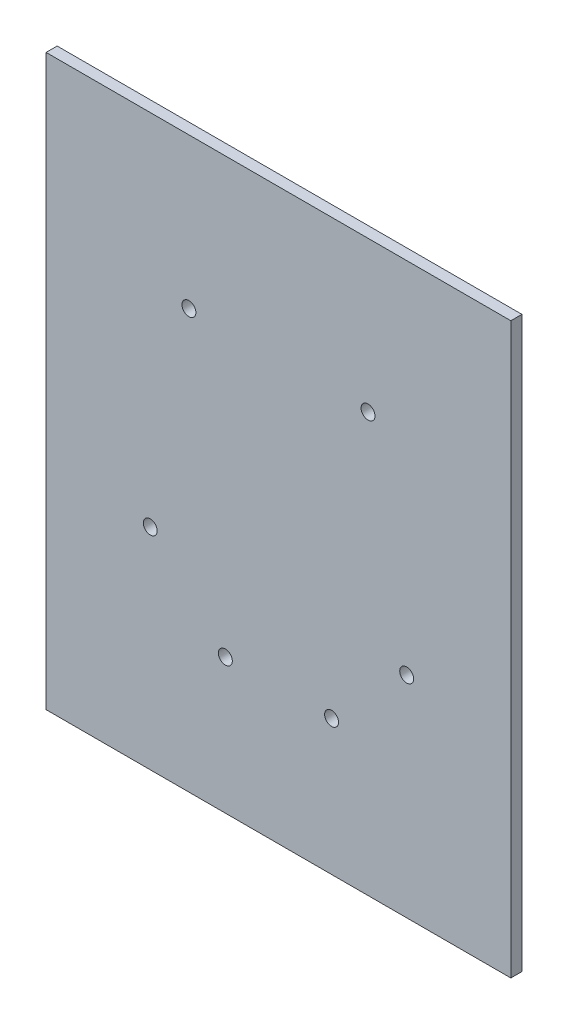
ISO-10303-21;
HEADER;
FILE_DESCRIPTION(('STEP AP214'),'2;1');
FILE_NAME('part.step','',(''),(''),'','','');
FILE_SCHEMA(('AUTOMOTIVE_DESIGN { 1 0 10303 214 1 1 1 1 }'));
ENDSEC;
DATA;
#1=APPLICATION_CONTEXT('core data for automotive mechanical design processes');
#2=APPLICATION_PROTOCOL_DEFINITION('international standard','automotive_design',2000,#1);
#3=PRODUCT_CONTEXT('',#1,'mechanical');
#4=PRODUCT('Part','Part','',(#3));
#5=PRODUCT_RELATED_PRODUCT_CATEGORY('part','',(#4));
#6=PRODUCT_DEFINITION_FORMATION('','',#4);
#7=PRODUCT_DEFINITION_CONTEXT('part definition',#1,'design');
#8=PRODUCT_DEFINITION('design','',#6,#7);
#9=PRODUCT_DEFINITION_SHAPE('','',#8);
#10=(LENGTH_UNIT() NAMED_UNIT(*) SI_UNIT(.MILLI.,.METRE.));
#11=(NAMED_UNIT(*) PLANE_ANGLE_UNIT() SI_UNIT($,.RADIAN.));
#12=(NAMED_UNIT(*) SI_UNIT($,.STERADIAN.) SOLID_ANGLE_UNIT());
#13=UNCERTAINTY_MEASURE_WITH_UNIT(LENGTH_MEASURE(1.E-05),#10,'distance_accuracy_value','');
#14=(GEOMETRIC_REPRESENTATION_CONTEXT(3) GLOBAL_UNCERTAINTY_ASSIGNED_CONTEXT((#13)) GLOBAL_UNIT_ASSIGNED_CONTEXT((#10,
#11,#12)) REPRESENTATION_CONTEXT('',''));
#15=CARTESIAN_POINT('',(0.,0.,0.));
#16=DIRECTION('',(0.,0.,1.));
#17=DIRECTION('',(1.,0.,0.));
#18=AXIS2_PLACEMENT_3D('',#15,#16,#17);
#19=CARTESIAN_POINT('',(0.,329.819,-229.489));
#20=DIRECTION('',(0.,0.,1.));
#21=DIRECTION('',(1.,0.,0.));
#22=AXIS2_PLACEMENT_3D('',#19,#20,#21);
#23=PLANE('',#22);
#24=DIRECTION('',(1.,0.,0.));
#25=VECTOR('',#24,1.);
#26=CARTESIAN_POINT('',(3.175,3.175,-229.489));
#27=LINE('',#26,#25);
#28=CARTESIAN_POINT('',(-263.525,3.17500000000004,-229.489));
#29=VERTEX_POINT('',#28);
#30=CARTESIAN_POINT('',(3.175,3.175,-229.489));
#31=VERTEX_POINT('',#30);
#32=EDGE_CURVE('E48',#29,#31,#27,.T.);
#33=ORIENTED_EDGE('',*,*,#32,.T.);
#34=DIRECTION('',(0.,1.,0.));
#35=VECTOR('',#34,1.);
#36=CARTESIAN_POINT('',(3.175,-3.175,-229.489));
#37=LINE('',#36,#35);
#38=CARTESIAN_POINT('',(3.175,329.819,-229.489));
#39=VERTEX_POINT('',#38);
#40=EDGE_CURVE('E77',#31,#39,#37,.T.);
#41=ORIENTED_EDGE('',*,*,#40,.T.);
#42=DIRECTION('',(-1.,0.,0.));
#43=VECTOR('',#42,1.);
#44=CARTESIAN_POINT('',(0.,329.819,-229.489));
#45=LINE('',#44,#43);
#46=CARTESIAN_POINT('',(-263.525,329.819,-229.489));
#47=VERTEX_POINT('',#46);
#48=EDGE_CURVE('E11',#39,#47,#45,.T.);
#49=ORIENTED_EDGE('',*,*,#48,.T.);
#50=DIRECTION('',(0.,-1.,0.));
#51=VECTOR('',#50,1.);
#52=CARTESIAN_POINT('',(-263.525,53.975,-229.489));
#53=LINE('',#52,#51);
#54=EDGE_CURVE('E85',#47,#29,#53,.T.);
#55=ORIENTED_EDGE('',*,*,#54,.T.);
#56=EDGE_LOOP('',(#33,#41,#49,#55));
#57=FACE_BOUND('',#56,.T.);
#58=CARTESIAN_POINT('',(-56.5897706188681,123.877229381132,-229.489));
#59=DIRECTION('',(0.,0.,1.));
#60=DIRECTION('',(1.,0.,0.));
#61=AXIS2_PLACEMENT_3D('',#58,#59,#60);
#62=CIRCLE('',#61,4.0005);
#63=CARTESIAN_POINT('',(-52.5892706188681,123.877229381132,-229.489));
#64=VERTEX_POINT('',#63);
#65=EDGE_CURVE('E119',#64,#64,#62,.T.);
#66=ORIENTED_EDGE('',*,*,#65,.F.);
#67=EDGE_LOOP('',(#66));
#68=FACE_BOUND('',#67,.T.);
#69=CARTESIAN_POINT('',(-203.760229381132,123.877229381132,-229.489));
#70=DIRECTION('',(0.,0.,1.));
#71=DIRECTION('',(1.,0.,0.));
#72=AXIS2_PLACEMENT_3D('',#69,#70,#71);
#73=CIRCLE('',#72,4.00049999999998);
#74=CARTESIAN_POINT('',(-199.759729381132,123.877229381132,-229.489));
#75=VERTEX_POINT('',#74);
#76=EDGE_CURVE('E124',#75,#75,#73,.T.);
#77=ORIENTED_EDGE('',*,*,#76,.F.);
#78=EDGE_LOOP('',(#77));
#79=FACE_BOUND('',#78,.T.);
#80=CARTESIAN_POINT('',(-99.695,80.772,-229.489));
#81=DIRECTION('',(0.,0.,1.));
#82=DIRECTION('',(1.,0.,0.));
#83=AXIS2_PLACEMENT_3D('',#80,#81,#82);
#84=CIRCLE('',#83,4.00050000000001);
#85=CARTESIAN_POINT('',(-95.6945,80.772,-229.489));
#86=VERTEX_POINT('',#85);
#87=EDGE_CURVE('E127',#86,#86,#84,.T.);
#88=ORIENTED_EDGE('',*,*,#87,.F.);
#89=EDGE_LOOP('',(#88));
#90=FACE_BOUND('',#89,.T.);
#91=CARTESIAN_POINT('',(-160.655,80.772,-229.489));
#92=DIRECTION('',(0.,0.,1.));
#93=DIRECTION('',(1.,0.,0.));
#94=AXIS2_PLACEMENT_3D('',#91,#92,#93);
#95=CIRCLE('',#94,4.00049999999998);
#96=CARTESIAN_POINT('',(-156.6545,80.772,-229.489));
#97=VERTEX_POINT('',#96);
#98=EDGE_CURVE('E130',#97,#97,#95,.T.);
#99=ORIENTED_EDGE('',*,*,#98,.F.);
#100=EDGE_LOOP('',(#99));
#101=FACE_BOUND('',#100,.T.);
#102=CARTESIAN_POINT('',(-78.7781,243.459,-229.489));
#103=DIRECTION('',(0.,0.,1.));
#104=DIRECTION('',(1.,0.,0.));
#105=AXIS2_PLACEMENT_3D('',#102,#103,#104);
#106=CIRCLE('',#105,4.00050000000001);
#107=CARTESIAN_POINT('',(-74.7776,243.459,-229.489));
#108=VERTEX_POINT('',#107);
#109=EDGE_CURVE('E133',#108,#108,#106,.T.);
#110=ORIENTED_EDGE('',*,*,#109,.F.);
#111=EDGE_LOOP('',(#110));
#112=FACE_BOUND('',#111,.T.);
#113=CARTESIAN_POINT('',(-181.5719,243.459,-229.489));
#114=DIRECTION('',(0.,0.,1.));
#115=DIRECTION('',(1.,0.,0.));
#116=AXIS2_PLACEMENT_3D('',#113,#114,#115);
#117=CIRCLE('',#116,4.00049999999998);
#118=CARTESIAN_POINT('',(-177.5714,243.459,-229.489));
#119=VERTEX_POINT('',#118);
#120=EDGE_CURVE('E41',#119,#119,#117,.T.);
#121=ORIENTED_EDGE('',*,*,#120,.F.);
#122=EDGE_LOOP('',(#121));
#123=FACE_BOUND('',#122,.T.);
#124=ADVANCED_FACE('F33',(#57,#68,#79,#90,#101,#112,#123),#23,.T.);
#125=CARTESIAN_POINT('',(0.,329.819,0.));
#126=DIRECTION('',(0.,1.,0.));
#127=DIRECTION('',(0.,0.,1.));
#128=AXIS2_PLACEMENT_3D('',#125,#126,#127);
#129=PLANE('',#128);
#130=ORIENTED_EDGE('',*,*,#48,.F.);
#131=DIRECTION('',(0.,0.,1.));
#132=VECTOR('',#131,1.);
#133=CARTESIAN_POINT('',(3.175,329.819,-235.839));
#134=LINE('',#133,#132);
#135=CARTESIAN_POINT('',(3.175,329.819,-235.839));
#136=VERTEX_POINT('',#135);
#137=EDGE_CURVE('E88',#136,#39,#134,.T.);
#138=ORIENTED_EDGE('',*,*,#137,.F.);
#139=DIRECTION('',(1.,0.,0.));
#140=VECTOR('',#139,1.);
#141=CARTESIAN_POINT('',(3.175,329.819,-235.839));
#142=LINE('',#141,#140);
#143=CARTESIAN_POINT('',(-263.525,329.819,-235.839));
#144=VERTEX_POINT('',#143);
#145=EDGE_CURVE('E114',#144,#136,#142,.T.);
#146=ORIENTED_EDGE('',*,*,#145,.F.);
#147=DIRECTION('',(0.,0.,-1.));
#148=VECTOR('',#147,1.);
#149=CARTESIAN_POINT('',(-263.525,329.819,-235.839));
#150=LINE('',#149,#148);
#151=EDGE_CURVE('E112',#47,#144,#150,.T.);
#152=ORIENTED_EDGE('',*,*,#151,.F.);
#153=EDGE_LOOP('',(#130,#138,#146,#152));
#154=FACE_BOUND('',#153,.T.);
#155=ADVANCED_FACE('F35',(#154),#129,.T.);
#156=CARTESIAN_POINT('',(-181.5719,243.459,-232.664));
#157=DIRECTION('',(0.,0.,1.));
#158=DIRECTION('',(1.,0.,0.));
#159=AXIS2_PLACEMENT_3D('',#156,#157,#158);
#160=CYLINDRICAL_SURFACE('',#159,4.00049999999998);
#161=CARTESIAN_POINT('',(-181.5719,243.459,-235.839));
#162=DIRECTION('',(0.,0.,-1.));
#163=DIRECTION('',(-1.,0.,0.));
#164=AXIS2_PLACEMENT_3D('',#161,#162,#163);
#165=CIRCLE('',#164,4.00050000000001);
#166=CARTESIAN_POINT('',(-177.5714,243.459,-235.839));
#167=VERTEX_POINT('',#166);
#168=EDGE_CURVE('E105',#167,#167,#165,.T.);
#169=CARTESIAN_POINT('',(-177.5714,243.459,-229.489));
#170=CARTESIAN_POINT('',(-177.5714,243.459,-229.555145833333));
#171=CARTESIAN_POINT('',(-177.5714,243.459,-229.621291666667));
#172=CARTESIAN_POINT('',(-177.5714,243.459,-229.753583333333));
#173=CARTESIAN_POINT('',(-177.5714,243.459,-229.819729166667));
#174=CARTESIAN_POINT('',(-177.5714,243.459,-229.952020833333));
#175=CARTESIAN_POINT('',(-177.5714,243.459,-230.018166666667));
#176=CARTESIAN_POINT('',(-177.5714,243.459,-230.150458333333));
#177=CARTESIAN_POINT('',(-177.5714,243.459,-230.216604166667));
#178=CARTESIAN_POINT('',(-177.5714,243.459,-230.348895833333));
#179=CARTESIAN_POINT('',(-177.5714,243.459,-230.415041666667));
#180=CARTESIAN_POINT('',(-177.5714,243.459,-230.547333333333));
#181=CARTESIAN_POINT('',(-177.5714,243.459,-230.613479166667));
#182=CARTESIAN_POINT('',(-177.5714,243.459,-230.745770833333));
#183=CARTESIAN_POINT('',(-177.5714,243.459,-230.811916666667));
#184=CARTESIAN_POINT('',(-177.5714,243.459,-230.944208333333));
#185=CARTESIAN_POINT('',(-177.5714,243.459,-231.010354166667));
#186=CARTESIAN_POINT('',(-177.5714,243.459,-231.142645833333));
#187=CARTESIAN_POINT('',(-177.5714,243.459,-231.208791666667));
#188=CARTESIAN_POINT('',(-177.5714,243.459,-231.341083333333));
#189=CARTESIAN_POINT('',(-177.5714,243.459,-231.407229166667));
#190=CARTESIAN_POINT('',(-177.5714,243.459,-231.539520833333));
#191=CARTESIAN_POINT('',(-177.5714,243.459,-231.605666666667));
#192=CARTESIAN_POINT('',(-177.5714,243.459,-231.737958333333));
#193=CARTESIAN_POINT('',(-177.5714,243.459,-231.804104166667));
#194=CARTESIAN_POINT('',(-177.5714,243.459,-231.936395833333));
#195=CARTESIAN_POINT('',(-177.5714,243.459,-232.002541666667));
#196=CARTESIAN_POINT('',(-177.5714,243.459,-232.134833333333));
#197=CARTESIAN_POINT('',(-177.5714,243.459,-232.200979166667));
#198=CARTESIAN_POINT('',(-177.5714,243.459,-232.333270833333));
#199=CARTESIAN_POINT('',(-177.5714,243.459,-232.399416666667));
#200=CARTESIAN_POINT('',(-177.5714,243.459,-232.531708333333));
#201=CARTESIAN_POINT('',(-177.5714,243.459,-232.597854166667));
#202=CARTESIAN_POINT('',(-177.5714,243.459,-232.730145833333));
#203=CARTESIAN_POINT('',(-177.5714,243.459,-232.796291666667));
#204=CARTESIAN_POINT('',(-177.5714,243.459,-232.928583333333));
#205=CARTESIAN_POINT('',(-177.5714,243.459,-232.994729166667));
#206=CARTESIAN_POINT('',(-177.5714,243.459,-233.127020833333));
#207=CARTESIAN_POINT('',(-177.5714,243.459,-233.193166666667));
#208=CARTESIAN_POINT('',(-177.5714,243.459,-233.325458333333));
#209=CARTESIAN_POINT('',(-177.5714,243.459,-233.391604166667));
#210=CARTESIAN_POINT('',(-177.5714,243.459,-233.523895833333));
#211=CARTESIAN_POINT('',(-177.5714,243.459,-233.590041666667));
#212=CARTESIAN_POINT('',(-177.5714,243.459,-233.722333333333));
#213=CARTESIAN_POINT('',(-177.5714,243.459,-233.788479166667));
#214=CARTESIAN_POINT('',(-177.5714,243.459,-233.920770833333));
#215=CARTESIAN_POINT('',(-177.5714,243.459,-233.986916666667));
#216=CARTESIAN_POINT('',(-177.5714,243.459,-234.119208333333));
#217=CARTESIAN_POINT('',(-177.5714,243.459,-234.185354166667));
#218=CARTESIAN_POINT('',(-177.5714,243.459,-234.317645833333));
#219=CARTESIAN_POINT('',(-177.5714,243.459,-234.383791666667));
#220=CARTESIAN_POINT('',(-177.5714,243.459,-234.516083333333));
#221=CARTESIAN_POINT('',(-177.5714,243.459,-234.582229166667));
#222=CARTESIAN_POINT('',(-177.5714,243.459,-234.714520833333));
#223=CARTESIAN_POINT('',(-177.5714,243.459,-234.780666666667));
#224=CARTESIAN_POINT('',(-177.5714,243.459,-234.912958333333));
#225=CARTESIAN_POINT('',(-177.5714,243.459,-234.979104166667));
#226=CARTESIAN_POINT('',(-177.5714,243.459,-235.111395833333));
#227=CARTESIAN_POINT('',(-177.5714,243.459,-235.177541666667));
#228=CARTESIAN_POINT('',(-177.5714,243.459,-235.309833333333));
#229=CARTESIAN_POINT('',(-177.5714,243.459,-235.375979166667));
#230=CARTESIAN_POINT('',(-177.5714,243.459,-235.508270833333));
#231=CARTESIAN_POINT('',(-177.5714,243.459,-235.574416666667));
#232=CARTESIAN_POINT('',(-177.5714,243.459,-235.706708333333));
#233=CARTESIAN_POINT('',(-177.5714,243.459,-235.772854166667));
#234=CARTESIAN_POINT('',(-177.5714,243.459,-235.839));
#235=B_SPLINE_CURVE_WITH_KNOTS('',3,(#169,#170,#171,#172,#173,#174,#175,#176,#177,#178,#179,
#180,#181,#182,#183,#184,#185,#186,#187,#188,#189,#190,#191,#192,#193,#194,#195,#196,#197,#198,
#199,#200,#201,#202,#203,#204,#205,#206,#207,#208,#209,#210,#211,#212,#213,#214,#215,#216,#217,
#218,#219,#220,#221,#222,#223,#224,#225,#226,#227,#228,#229,#230,#231,#232,#233,#234),
.UNSPECIFIED.,.F.,.F.,(4,2,2,2,2,2,2,2,2,2,2,2,2,2,2,2,2,2,2,2,2,2,2,2,2,2,2,2,2,2,2,2,4),(0.,
0.198437500000009,0.396875000000019,0.595312500000028,0.79375000000001,0.992187500000019,
1.19062500000003,1.38906250000001,1.58750000000002,1.78593750000003,1.98437500000001,
2.18281250000002,2.38125000000003,2.57968750000001,2.77812500000002,2.97656250000003,
3.17500000000001,3.37343750000002,3.57187500000003,3.77031250000004,3.96875000000002,
4.16718750000003,4.36562500000004,4.56406250000002,4.76250000000003,4.96093750000004,
5.15937500000002,5.35781250000003,5.55625000000004,5.75468750000002,5.95312500000003,
6.15156250000004,6.35000000000002),.UNSPECIFIED.);
#236=EDGE_CURVE('BSEAM138',#119,#167,#235,.T.);
#237=ORIENTED_EDGE('',*,*,#120,.T.);
#238=ORIENTED_EDGE('',*,*,#168,.T.);
#239=ORIENTED_EDGE('',*,*,#236,.T.);
#240=ORIENTED_EDGE('',*,*,#236,.F.);
#241=EDGE_LOOP('',(#237,#239,#238,#240));
#242=FACE_BOUND('',#241,.T.);
#243=ADVANCED_FACE('F138',(#242),#160,.F.);
#244=CARTESIAN_POINT('',(-78.7781,243.459,-232.664));
#245=DIRECTION('',(0.,0.,1.));
#246=DIRECTION('',(1.,0.,0.));
#247=AXIS2_PLACEMENT_3D('',#244,#245,#246);
#248=CYLINDRICAL_SURFACE('',#247,4.00050000000001);
#249=CARTESIAN_POINT('',(-78.7781,243.459,-235.839));
#250=DIRECTION('',(0.,0.,-1.));
#251=DIRECTION('',(-1.,0.,0.));
#252=AXIS2_PLACEMENT_3D('',#249,#250,#251);
#253=CIRCLE('',#252,4.00050000000001);
#254=CARTESIAN_POINT('',(-74.7776,243.459,-235.839));
#255=VERTEX_POINT('',#254);
#256=EDGE_CURVE('E108',#255,#255,#253,.T.);
#257=CARTESIAN_POINT('',(-74.7776,243.459,-229.489));
#258=CARTESIAN_POINT('',(-74.7776,243.459,-229.555145833333));
#259=CARTESIAN_POINT('',(-74.7776,243.459,-229.621291666667));
#260=CARTESIAN_POINT('',(-74.7776,243.459,-229.753583333333));
#261=CARTESIAN_POINT('',(-74.7776,243.459,-229.819729166667));
#262=CARTESIAN_POINT('',(-74.7776,243.459,-229.952020833333));
#263=CARTESIAN_POINT('',(-74.7776,243.459,-230.018166666667));
#264=CARTESIAN_POINT('',(-74.7776,243.459,-230.150458333333));
#265=CARTESIAN_POINT('',(-74.7776,243.459,-230.216604166667));
#266=CARTESIAN_POINT('',(-74.7776,243.459,-230.348895833333));
#267=CARTESIAN_POINT('',(-74.7776,243.459,-230.415041666667));
#268=CARTESIAN_POINT('',(-74.7776,243.459,-230.547333333333));
#269=CARTESIAN_POINT('',(-74.7776,243.459,-230.613479166667));
#270=CARTESIAN_POINT('',(-74.7776,243.459,-230.745770833333));
#271=CARTESIAN_POINT('',(-74.7776,243.459,-230.811916666667));
#272=CARTESIAN_POINT('',(-74.7776,243.459,-230.944208333333));
#273=CARTESIAN_POINT('',(-74.7776,243.459,-231.010354166667));
#274=CARTESIAN_POINT('',(-74.7776,243.459,-231.142645833333));
#275=CARTESIAN_POINT('',(-74.7776,243.459,-231.208791666667));
#276=CARTESIAN_POINT('',(-74.7776,243.459,-231.341083333333));
#277=CARTESIAN_POINT('',(-74.7776,243.459,-231.407229166667));
#278=CARTESIAN_POINT('',(-74.7776,243.459,-231.539520833333));
#279=CARTESIAN_POINT('',(-74.7776,243.459,-231.605666666667));
#280=CARTESIAN_POINT('',(-74.7776,243.459,-231.737958333333));
#281=CARTESIAN_POINT('',(-74.7776,243.459,-231.804104166667));
#282=CARTESIAN_POINT('',(-74.7776,243.459,-231.936395833333));
#283=CARTESIAN_POINT('',(-74.7776,243.459,-232.002541666667));
#284=CARTESIAN_POINT('',(-74.7776,243.459,-232.134833333333));
#285=CARTESIAN_POINT('',(-74.7776,243.459,-232.200979166667));
#286=CARTESIAN_POINT('',(-74.7776,243.459,-232.333270833333));
#287=CARTESIAN_POINT('',(-74.7776,243.459,-232.399416666667));
#288=CARTESIAN_POINT('',(-74.7776,243.459,-232.531708333333));
#289=CARTESIAN_POINT('',(-74.7776,243.459,-232.597854166667));
#290=CARTESIAN_POINT('',(-74.7776,243.459,-232.730145833333));
#291=CARTESIAN_POINT('',(-74.7776,243.459,-232.796291666667));
#292=CARTESIAN_POINT('',(-74.7776,243.459,-232.928583333333));
#293=CARTESIAN_POINT('',(-74.7776,243.459,-232.994729166667));
#294=CARTESIAN_POINT('',(-74.7776,243.459,-233.127020833333));
#295=CARTESIAN_POINT('',(-74.7776,243.459,-233.193166666667));
#296=CARTESIAN_POINT('',(-74.7776,243.459,-233.325458333333));
#297=CARTESIAN_POINT('',(-74.7776,243.459,-233.391604166667));
#298=CARTESIAN_POINT('',(-74.7776,243.459,-233.523895833333));
#299=CARTESIAN_POINT('',(-74.7776,243.459,-233.590041666667));
#300=CARTESIAN_POINT('',(-74.7776,243.459,-233.722333333333));
#301=CARTESIAN_POINT('',(-74.7776,243.459,-233.788479166667));
#302=CARTESIAN_POINT('',(-74.7776,243.459,-233.920770833333));
#303=CARTESIAN_POINT('',(-74.7776,243.459,-233.986916666667));
#304=CARTESIAN_POINT('',(-74.7776,243.459,-234.119208333333));
#305=CARTESIAN_POINT('',(-74.7776,243.459,-234.185354166667));
#306=CARTESIAN_POINT('',(-74.7776,243.459,-234.317645833333));
#307=CARTESIAN_POINT('',(-74.7776,243.459,-234.383791666667));
#308=CARTESIAN_POINT('',(-74.7776,243.459,-234.516083333333));
#309=CARTESIAN_POINT('',(-74.7776,243.459,-234.582229166667));
#310=CARTESIAN_POINT('',(-74.7776,243.459,-234.714520833333));
#311=CARTESIAN_POINT('',(-74.7776,243.459,-234.780666666667));
#312=CARTESIAN_POINT('',(-74.7776,243.459,-234.912958333333));
#313=CARTESIAN_POINT('',(-74.7776,243.459,-234.979104166667));
#314=CARTESIAN_POINT('',(-74.7776,243.459,-235.111395833333));
#315=CARTESIAN_POINT('',(-74.7776,243.459,-235.177541666667));
#316=CARTESIAN_POINT('',(-74.7776,243.459,-235.309833333333));
#317=CARTESIAN_POINT('',(-74.7776,243.459,-235.375979166667));
#318=CARTESIAN_POINT('',(-74.7776,243.459,-235.508270833333));
#319=CARTESIAN_POINT('',(-74.7776,243.459,-235.574416666667));
#320=CARTESIAN_POINT('',(-74.7776,243.459,-235.706708333333));
#321=CARTESIAN_POINT('',(-74.7776,243.459,-235.772854166667));
#322=CARTESIAN_POINT('',(-74.7776,243.459,-235.839));
#323=B_SPLINE_CURVE_WITH_KNOTS('',3,(#257,#258,#259,#260,#261,#262,#263,#264,#265,#266,#267,
#268,#269,#270,#271,#272,#273,#274,#275,#276,#277,#278,#279,#280,#281,#282,#283,#284,#285,#286,
#287,#288,#289,#290,#291,#292,#293,#294,#295,#296,#297,#298,#299,#300,#301,#302,#303,#304,#305,
#306,#307,#308,#309,#310,#311,#312,#313,#314,#315,#316,#317,#318,#319,#320,#321,#322),
.UNSPECIFIED.,.F.,.F.,(4,2,2,2,2,2,2,2,2,2,2,2,2,2,2,2,2,2,2,2,2,2,2,2,2,2,2,2,2,2,2,2,4),(0.,
0.198437499999982,0.396874999999991,0.595312499999973,0.793749999999982,0.992187499999991,
1.19062499999997,1.38906249999998,1.58749999999999,1.78593749999997,1.98437499999998,
2.18281249999999,2.38124999999997,2.57968749999998,2.77812499999999,2.97656249999997,
3.17499999999998,3.37343749999999,3.57187499999997,3.77031249999998,3.96874999999999,
4.16718749999997,4.36562499999998,4.56406249999999,4.76249999999998,4.96093749999998,
5.15937499999999,5.35781249999998,5.55624999999998,5.75468749999999,5.95312499999998,
6.15156249999998,6.34999999999997),.UNSPECIFIED.);
#324=EDGE_CURVE('BSEAM149',#108,#255,#323,.T.);
#325=ORIENTED_EDGE('',*,*,#109,.T.);
#326=ORIENTED_EDGE('',*,*,#256,.T.);
#327=ORIENTED_EDGE('',*,*,#324,.T.);
#328=ORIENTED_EDGE('',*,*,#324,.F.);
#329=EDGE_LOOP('',(#325,#327,#326,#328));
#330=FACE_BOUND('',#329,.T.);
#331=ADVANCED_FACE('F149',(#330),#248,.F.);
#332=CARTESIAN_POINT('',(-160.655,80.772,-232.664));
#333=DIRECTION('',(0.,0.,1.));
#334=DIRECTION('',(1.,0.,0.));
#335=AXIS2_PLACEMENT_3D('',#332,#333,#334);
#336=CYLINDRICAL_SURFACE('',#335,4.00049999999998);
#337=CARTESIAN_POINT('',(-160.655,80.772,-235.839));
#338=DIRECTION('',(0.,0.,-1.));
#339=DIRECTION('',(-1.,0.,0.));
#340=AXIS2_PLACEMENT_3D('',#337,#338,#339);
#341=CIRCLE('',#340,4.00049999999998);
#342=CARTESIAN_POINT('',(-156.6545,80.772,-235.839));
#343=VERTEX_POINT('',#342);
#344=EDGE_CURVE('E96',#343,#343,#341,.T.);
#345=CARTESIAN_POINT('',(-156.6545,80.772,-229.489));
#346=CARTESIAN_POINT('',(-156.6545,80.772,-229.555145833333));
#347=CARTESIAN_POINT('',(-156.6545,80.772,-229.621291666667));
#348=CARTESIAN_POINT('',(-156.6545,80.772,-229.753583333333));
#349=CARTESIAN_POINT('',(-156.6545,80.772,-229.819729166667));
#350=CARTESIAN_POINT('',(-156.6545,80.772,-229.952020833333));
#351=CARTESIAN_POINT('',(-156.6545,80.772,-230.018166666667));
#352=CARTESIAN_POINT('',(-156.6545,80.772,-230.150458333333));
#353=CARTESIAN_POINT('',(-156.6545,80.772,-230.216604166667));
#354=CARTESIAN_POINT('',(-156.6545,80.772,-230.348895833333));
#355=CARTESIAN_POINT('',(-156.6545,80.772,-230.415041666667));
#356=CARTESIAN_POINT('',(-156.6545,80.772,-230.547333333333));
#357=CARTESIAN_POINT('',(-156.6545,80.772,-230.613479166667));
#358=CARTESIAN_POINT('',(-156.6545,80.772,-230.745770833333));
#359=CARTESIAN_POINT('',(-156.6545,80.772,-230.811916666667));
#360=CARTESIAN_POINT('',(-156.6545,80.772,-230.944208333333));
#361=CARTESIAN_POINT('',(-156.6545,80.772,-231.010354166667));
#362=CARTESIAN_POINT('',(-156.6545,80.772,-231.142645833333));
#363=CARTESIAN_POINT('',(-156.6545,80.772,-231.208791666667));
#364=CARTESIAN_POINT('',(-156.6545,80.772,-231.341083333333));
#365=CARTESIAN_POINT('',(-156.6545,80.772,-231.407229166667));
#366=CARTESIAN_POINT('',(-156.6545,80.772,-231.539520833333));
#367=CARTESIAN_POINT('',(-156.6545,80.772,-231.605666666667));
#368=CARTESIAN_POINT('',(-156.6545,80.772,-231.737958333333));
#369=CARTESIAN_POINT('',(-156.6545,80.772,-231.804104166667));
#370=CARTESIAN_POINT('',(-156.6545,80.772,-231.936395833333));
#371=CARTESIAN_POINT('',(-156.6545,80.772,-232.002541666667));
#372=CARTESIAN_POINT('',(-156.6545,80.772,-232.134833333333));
#373=CARTESIAN_POINT('',(-156.6545,80.772,-232.200979166667));
#374=CARTESIAN_POINT('',(-156.6545,80.772,-232.333270833333));
#375=CARTESIAN_POINT('',(-156.6545,80.772,-232.399416666667));
#376=CARTESIAN_POINT('',(-156.6545,80.772,-232.531708333333));
#377=CARTESIAN_POINT('',(-156.6545,80.772,-232.597854166667));
#378=CARTESIAN_POINT('',(-156.6545,80.772,-232.730145833333));
#379=CARTESIAN_POINT('',(-156.6545,80.772,-232.796291666667));
#380=CARTESIAN_POINT('',(-156.6545,80.772,-232.928583333333));
#381=CARTESIAN_POINT('',(-156.6545,80.772,-232.994729166667));
#382=CARTESIAN_POINT('',(-156.6545,80.772,-233.127020833333));
#383=CARTESIAN_POINT('',(-156.6545,80.772,-233.193166666667));
#384=CARTESIAN_POINT('',(-156.6545,80.772,-233.325458333333));
#385=CARTESIAN_POINT('',(-156.6545,80.772,-233.391604166667));
#386=CARTESIAN_POINT('',(-156.6545,80.772,-233.523895833333));
#387=CARTESIAN_POINT('',(-156.6545,80.772,-233.590041666667));
#388=CARTESIAN_POINT('',(-156.6545,80.772,-233.722333333333));
#389=CARTESIAN_POINT('',(-156.6545,80.772,-233.788479166667));
#390=CARTESIAN_POINT('',(-156.6545,80.772,-233.920770833333));
#391=CARTESIAN_POINT('',(-156.6545,80.772,-233.986916666667));
#392=CARTESIAN_POINT('',(-156.6545,80.772,-234.119208333333));
#393=CARTESIAN_POINT('',(-156.6545,80.772,-234.185354166667));
#394=CARTESIAN_POINT('',(-156.6545,80.772,-234.317645833333));
#395=CARTESIAN_POINT('',(-156.6545,80.772,-234.383791666667));
#396=CARTESIAN_POINT('',(-156.6545,80.772,-234.516083333333));
#397=CARTESIAN_POINT('',(-156.6545,80.772,-234.582229166667));
#398=CARTESIAN_POINT('',(-156.6545,80.772,-234.714520833333));
#399=CARTESIAN_POINT('',(-156.6545,80.772,-234.780666666667));
#400=CARTESIAN_POINT('',(-156.6545,80.772,-234.912958333333));
#401=CARTESIAN_POINT('',(-156.6545,80.772,-234.979104166667));
#402=CARTESIAN_POINT('',(-156.6545,80.772,-235.111395833333));
#403=CARTESIAN_POINT('',(-156.6545,80.772,-235.177541666667));
#404=CARTESIAN_POINT('',(-156.6545,80.772,-235.309833333333));
#405=CARTESIAN_POINT('',(-156.6545,80.772,-235.375979166667));
#406=CARTESIAN_POINT('',(-156.6545,80.772,-235.508270833333));
#407=CARTESIAN_POINT('',(-156.6545,80.772,-235.574416666667));
#408=CARTESIAN_POINT('',(-156.6545,80.772,-235.706708333333));
#409=CARTESIAN_POINT('',(-156.6545,80.772,-235.772854166667));
#410=CARTESIAN_POINT('',(-156.6545,80.772,-235.839));
#411=B_SPLINE_CURVE_WITH_KNOTS('',3,(#345,#346,#347,#348,#349,#350,#351,#352,#353,#354,#355,
#356,#357,#358,#359,#360,#361,#362,#363,#364,#365,#366,#367,#368,#369,#370,#371,#372,#373,#374,
#375,#376,#377,#378,#379,#380,#381,#382,#383,#384,#385,#386,#387,#388,#389,#390,#391,#392,#393,
#394,#395,#396,#397,#398,#399,#400,#401,#402,#403,#404,#405,#406,#407,#408,#409,#410),
.UNSPECIFIED.,.F.,.F.,(4,2,2,2,2,2,2,2,2,2,2,2,2,2,2,2,2,2,2,2,2,2,2,2,2,2,2,2,2,2,2,2,4),(0.,
0.198437500000009,0.396875000000019,0.595312500000028,0.79375000000001,0.992187500000019,
1.19062500000003,1.38906250000001,1.58750000000002,1.78593750000003,1.98437500000001,
2.18281250000002,2.38125000000003,2.57968750000001,2.77812500000002,2.97656250000003,
3.17500000000001,3.37343750000002,3.57187500000003,3.77031250000004,3.96875000000002,
4.16718750000003,4.36562500000004,4.56406250000002,4.76250000000003,4.96093750000004,
5.15937500000002,5.35781250000003,5.55625000000004,5.75468750000002,5.95312500000003,
6.15156250000004,6.35000000000002),.UNSPECIFIED.);
#412=EDGE_CURVE('BSEAM152',#97,#343,#411,.T.);
#413=ORIENTED_EDGE('',*,*,#98,.T.);
#414=ORIENTED_EDGE('',*,*,#344,.T.);
#415=ORIENTED_EDGE('',*,*,#412,.T.);
#416=ORIENTED_EDGE('',*,*,#412,.F.);
#417=EDGE_LOOP('',(#413,#415,#414,#416));
#418=FACE_BOUND('',#417,.T.);
#419=ADVANCED_FACE('F152',(#418),#336,.F.);
#420=CARTESIAN_POINT('',(-99.695,80.772,-232.664));
#421=DIRECTION('',(0.,0.,1.));
#422=DIRECTION('',(1.,0.,0.));
#423=AXIS2_PLACEMENT_3D('',#420,#421,#422);
#424=CYLINDRICAL_SURFACE('',#423,4.00050000000001);
#425=CARTESIAN_POINT('',(-99.695,80.772,-235.839));
#426=DIRECTION('',(0.,0.,-1.));
#427=DIRECTION('',(-1.,0.,0.));
#428=AXIS2_PLACEMENT_3D('',#425,#426,#427);
#429=CIRCLE('',#428,4.00050000000001);
#430=CARTESIAN_POINT('',(-95.6945,80.772,-235.839));
#431=VERTEX_POINT('',#430);
#432=EDGE_CURVE('E99',#431,#431,#429,.T.);
#433=CARTESIAN_POINT('',(-95.6945,80.772,-229.489));
#434=CARTESIAN_POINT('',(-95.6945,80.772,-229.555145833333));
#435=CARTESIAN_POINT('',(-95.6945,80.772,-229.621291666667));
#436=CARTESIAN_POINT('',(-95.6945,80.772,-229.753583333333));
#437=CARTESIAN_POINT('',(-95.6945,80.772,-229.819729166667));
#438=CARTESIAN_POINT('',(-95.6945,80.772,-229.952020833333));
#439=CARTESIAN_POINT('',(-95.6945,80.772,-230.018166666667));
#440=CARTESIAN_POINT('',(-95.6945,80.772,-230.150458333333));
#441=CARTESIAN_POINT('',(-95.6945,80.772,-230.216604166667));
#442=CARTESIAN_POINT('',(-95.6945,80.772,-230.348895833333));
#443=CARTESIAN_POINT('',(-95.6945,80.772,-230.415041666667));
#444=CARTESIAN_POINT('',(-95.6945,80.772,-230.547333333333));
#445=CARTESIAN_POINT('',(-95.6945,80.772,-230.613479166667));
#446=CARTESIAN_POINT('',(-95.6945,80.772,-230.745770833333));
#447=CARTESIAN_POINT('',(-95.6945,80.772,-230.811916666667));
#448=CARTESIAN_POINT('',(-95.6945,80.772,-230.944208333333));
#449=CARTESIAN_POINT('',(-95.6945,80.772,-231.010354166667));
#450=CARTESIAN_POINT('',(-95.6945,80.772,-231.142645833333));
#451=CARTESIAN_POINT('',(-95.6945,80.772,-231.208791666667));
#452=CARTESIAN_POINT('',(-95.6945,80.772,-231.341083333333));
#453=CARTESIAN_POINT('',(-95.6945,80.772,-231.407229166667));
#454=CARTESIAN_POINT('',(-95.6945,80.772,-231.539520833333));
#455=CARTESIAN_POINT('',(-95.6945,80.772,-231.605666666667));
#456=CARTESIAN_POINT('',(-95.6945,80.772,-231.737958333333));
#457=CARTESIAN_POINT('',(-95.6945,80.772,-231.804104166667));
#458=CARTESIAN_POINT('',(-95.6945,80.772,-231.936395833333));
#459=CARTESIAN_POINT('',(-95.6945,80.772,-232.002541666667));
#460=CARTESIAN_POINT('',(-95.6945,80.772,-232.134833333333));
#461=CARTESIAN_POINT('',(-95.6945,80.772,-232.200979166667));
#462=CARTESIAN_POINT('',(-95.6945,80.772,-232.333270833333));
#463=CARTESIAN_POINT('',(-95.6945,80.772,-232.399416666667));
#464=CARTESIAN_POINT('',(-95.6945,80.772,-232.531708333333));
#465=CARTESIAN_POINT('',(-95.6945,80.772,-232.597854166667));
#466=CARTESIAN_POINT('',(-95.6945,80.772,-232.730145833333));
#467=CARTESIAN_POINT('',(-95.6945,80.772,-232.796291666667));
#468=CARTESIAN_POINT('',(-95.6945,80.772,-232.928583333333));
#469=CARTESIAN_POINT('',(-95.6945,80.772,-232.994729166667));
#470=CARTESIAN_POINT('',(-95.6945,80.772,-233.127020833333));
#471=CARTESIAN_POINT('',(-95.6945,80.772,-233.193166666667));
#472=CARTESIAN_POINT('',(-95.6945,80.772,-233.325458333333));
#473=CARTESIAN_POINT('',(-95.6945,80.772,-233.391604166667));
#474=CARTESIAN_POINT('',(-95.6945,80.772,-233.523895833333));
#475=CARTESIAN_POINT('',(-95.6945,80.772,-233.590041666667));
#476=CARTESIAN_POINT('',(-95.6945,80.772,-233.722333333333));
#477=CARTESIAN_POINT('',(-95.6945,80.772,-233.788479166667));
#478=CARTESIAN_POINT('',(-95.6945,80.772,-233.920770833333));
#479=CARTESIAN_POINT('',(-95.6945,80.772,-233.986916666667));
#480=CARTESIAN_POINT('',(-95.6945,80.772,-234.119208333333));
#481=CARTESIAN_POINT('',(-95.6945,80.772,-234.185354166667));
#482=CARTESIAN_POINT('',(-95.6945,80.772,-234.317645833333));
#483=CARTESIAN_POINT('',(-95.6945,80.772,-234.383791666667));
#484=CARTESIAN_POINT('',(-95.6945,80.772,-234.516083333333));
#485=CARTESIAN_POINT('',(-95.6945,80.772,-234.582229166667));
#486=CARTESIAN_POINT('',(-95.6945,80.772,-234.714520833333));
#487=CARTESIAN_POINT('',(-95.6945,80.772,-234.780666666667));
#488=CARTESIAN_POINT('',(-95.6945,80.772,-234.912958333333));
#489=CARTESIAN_POINT('',(-95.6945,80.772,-234.979104166667));
#490=CARTESIAN_POINT('',(-95.6945,80.772,-235.111395833333));
#491=CARTESIAN_POINT('',(-95.6945,80.772,-235.177541666667));
#492=CARTESIAN_POINT('',(-95.6945,80.772,-235.309833333333));
#493=CARTESIAN_POINT('',(-95.6945,80.772,-235.375979166667));
#494=CARTESIAN_POINT('',(-95.6945,80.772,-235.508270833333));
#495=CARTESIAN_POINT('',(-95.6945,80.772,-235.574416666667));
#496=CARTESIAN_POINT('',(-95.6945,80.772,-235.706708333333));
#497=CARTESIAN_POINT('',(-95.6945,80.772,-235.772854166667));
#498=CARTESIAN_POINT('',(-95.6945,80.772,-235.839));
#499=B_SPLINE_CURVE_WITH_KNOTS('',3,(#433,#434,#435,#436,#437,#438,#439,#440,#441,#442,#443,
#444,#445,#446,#447,#448,#449,#450,#451,#452,#453,#454,#455,#456,#457,#458,#459,#460,#461,#462,
#463,#464,#465,#466,#467,#468,#469,#470,#471,#472,#473,#474,#475,#476,#477,#478,#479,#480,#481,
#482,#483,#484,#485,#486,#487,#488,#489,#490,#491,#492,#493,#494,#495,#496,#497,#498),
.UNSPECIFIED.,.F.,.F.,(4,2,2,2,2,2,2,2,2,2,2,2,2,2,2,2,2,2,2,2,2,2,2,2,2,2,2,2,2,2,2,2,4),(0.,
0.198437499999982,0.396874999999991,0.595312499999973,0.793749999999982,0.992187499999991,
1.19062499999997,1.38906249999998,1.58749999999999,1.78593749999997,1.98437499999998,
2.18281249999999,2.38124999999997,2.57968749999998,2.77812499999999,2.97656249999997,
3.17499999999998,3.37343749999999,3.57187499999997,3.77031249999998,3.96874999999999,
4.16718749999997,4.36562499999998,4.56406249999999,4.76249999999998,4.96093749999998,
5.15937499999999,5.35781249999998,5.55624999999998,5.75468749999999,5.95312499999998,
6.15156249999998,6.34999999999997),.UNSPECIFIED.);
#500=EDGE_CURVE('BSEAM156',#86,#431,#499,.T.);
#501=ORIENTED_EDGE('',*,*,#87,.T.);
#502=ORIENTED_EDGE('',*,*,#432,.T.);
#503=ORIENTED_EDGE('',*,*,#500,.T.);
#504=ORIENTED_EDGE('',*,*,#500,.F.);
#505=EDGE_LOOP('',(#501,#503,#502,#504));
#506=FACE_BOUND('',#505,.T.);
#507=ADVANCED_FACE('F156',(#506),#424,.F.);
#508=CARTESIAN_POINT('',(-203.760229381132,123.877229381132,-232.664));
#509=DIRECTION('',(0.,0.,1.));
#510=DIRECTION('',(1.,0.,0.));
#511=AXIS2_PLACEMENT_3D('',#508,#509,#510);
#512=CYLINDRICAL_SURFACE('',#511,4.00049999999998);
#513=CARTESIAN_POINT('',(-203.760229381132,123.877229381132,-235.839));
#514=DIRECTION('',(0.,0.,-1.));
#515=DIRECTION('',(-1.,0.,0.));
#516=AXIS2_PLACEMENT_3D('',#513,#514,#515);
#517=CIRCLE('',#516,4.00050000000001);
#518=CARTESIAN_POINT('',(-199.759729381132,123.877229381132,-235.839));
#519=VERTEX_POINT('',#518);
#520=EDGE_CURVE('E90',#519,#519,#517,.T.);
#521=CARTESIAN_POINT('',(-199.759729381132,123.877229381132,-229.489));
#522=CARTESIAN_POINT('',(-199.759729381132,123.877229381132,-229.555145833333));
#523=CARTESIAN_POINT('',(-199.759729381132,123.877229381132,-229.621291666667));
#524=CARTESIAN_POINT('',(-199.759729381132,123.877229381132,-229.753583333333));
#525=CARTESIAN_POINT('',(-199.759729381132,123.877229381132,-229.819729166667));
#526=CARTESIAN_POINT('',(-199.759729381132,123.877229381132,-229.952020833333));
#527=CARTESIAN_POINT('',(-199.759729381132,123.877229381132,-230.018166666667));
#528=CARTESIAN_POINT('',(-199.759729381132,123.877229381132,-230.150458333333));
#529=CARTESIAN_POINT('',(-199.759729381132,123.877229381132,-230.216604166667));
#530=CARTESIAN_POINT('',(-199.759729381132,123.877229381132,-230.348895833333));
#531=CARTESIAN_POINT('',(-199.759729381132,123.877229381132,-230.415041666667));
#532=CARTESIAN_POINT('',(-199.759729381132,123.877229381132,-230.547333333333));
#533=CARTESIAN_POINT('',(-199.759729381132,123.877229381132,-230.613479166667));
#534=CARTESIAN_POINT('',(-199.759729381132,123.877229381132,-230.745770833333));
#535=CARTESIAN_POINT('',(-199.759729381132,123.877229381132,-230.811916666667));
#536=CARTESIAN_POINT('',(-199.759729381132,123.877229381132,-230.944208333333));
#537=CARTESIAN_POINT('',(-199.759729381132,123.877229381132,-231.010354166667));
#538=CARTESIAN_POINT('',(-199.759729381132,123.877229381132,-231.142645833333));
#539=CARTESIAN_POINT('',(-199.759729381132,123.877229381132,-231.208791666667));
#540=CARTESIAN_POINT('',(-199.759729381132,123.877229381132,-231.341083333333));
#541=CARTESIAN_POINT('',(-199.759729381132,123.877229381132,-231.407229166667));
#542=CARTESIAN_POINT('',(-199.759729381132,123.877229381132,-231.539520833333));
#543=CARTESIAN_POINT('',(-199.759729381132,123.877229381132,-231.605666666667));
#544=CARTESIAN_POINT('',(-199.759729381132,123.877229381132,-231.737958333333));
#545=CARTESIAN_POINT('',(-199.759729381132,123.877229381132,-231.804104166667));
#546=CARTESIAN_POINT('',(-199.759729381132,123.877229381132,-231.936395833333));
#547=CARTESIAN_POINT('',(-199.759729381132,123.877229381132,-232.002541666667));
#548=CARTESIAN_POINT('',(-199.759729381132,123.877229381132,-232.134833333333));
#549=CARTESIAN_POINT('',(-199.759729381132,123.877229381132,-232.200979166667));
#550=CARTESIAN_POINT('',(-199.759729381132,123.877229381132,-232.333270833333));
#551=CARTESIAN_POINT('',(-199.759729381132,123.877229381132,-232.399416666667));
#552=CARTESIAN_POINT('',(-199.759729381132,123.877229381132,-232.531708333333));
#553=CARTESIAN_POINT('',(-199.759729381132,123.877229381132,-232.597854166667));
#554=CARTESIAN_POINT('',(-199.759729381132,123.877229381132,-232.730145833333));
#555=CARTESIAN_POINT('',(-199.759729381132,123.877229381132,-232.796291666667));
#556=CARTESIAN_POINT('',(-199.759729381132,123.877229381132,-232.928583333333));
#557=CARTESIAN_POINT('',(-199.759729381132,123.877229381132,-232.994729166667));
#558=CARTESIAN_POINT('',(-199.759729381132,123.877229381132,-233.127020833333));
#559=CARTESIAN_POINT('',(-199.759729381132,123.877229381132,-233.193166666667));
#560=CARTESIAN_POINT('',(-199.759729381132,123.877229381132,-233.325458333333));
#561=CARTESIAN_POINT('',(-199.759729381132,123.877229381132,-233.391604166667));
#562=CARTESIAN_POINT('',(-199.759729381132,123.877229381132,-233.523895833333));
#563=CARTESIAN_POINT('',(-199.759729381132,123.877229381132,-233.590041666667));
#564=CARTESIAN_POINT('',(-199.759729381132,123.877229381132,-233.722333333333));
#565=CARTESIAN_POINT('',(-199.759729381132,123.877229381132,-233.788479166667));
#566=CARTESIAN_POINT('',(-199.759729381132,123.877229381132,-233.920770833333));
#567=CARTESIAN_POINT('',(-199.759729381132,123.877229381132,-233.986916666667));
#568=CARTESIAN_POINT('',(-199.759729381132,123.877229381132,-234.119208333333));
#569=CARTESIAN_POINT('',(-199.759729381132,123.877229381132,-234.185354166667));
#570=CARTESIAN_POINT('',(-199.759729381132,123.877229381132,-234.317645833333));
#571=CARTESIAN_POINT('',(-199.759729381132,123.877229381132,-234.383791666667));
#572=CARTESIAN_POINT('',(-199.759729381132,123.877229381132,-234.516083333333));
#573=CARTESIAN_POINT('',(-199.759729381132,123.877229381132,-234.582229166667));
#574=CARTESIAN_POINT('',(-199.759729381132,123.877229381132,-234.714520833333));
#575=CARTESIAN_POINT('',(-199.759729381132,123.877229381132,-234.780666666667));
#576=CARTESIAN_POINT('',(-199.759729381132,123.877229381132,-234.912958333333));
#577=CARTESIAN_POINT('',(-199.759729381132,123.877229381132,-234.979104166667));
#578=CARTESIAN_POINT('',(-199.759729381132,123.877229381132,-235.111395833333));
#579=CARTESIAN_POINT('',(-199.759729381132,123.877229381132,-235.177541666667));
#580=CARTESIAN_POINT('',(-199.759729381132,123.877229381132,-235.309833333333));
#581=CARTESIAN_POINT('',(-199.759729381132,123.877229381132,-235.375979166667));
#582=CARTESIAN_POINT('',(-199.759729381132,123.877229381132,-235.508270833333));
#583=CARTESIAN_POINT('',(-199.759729381132,123.877229381132,-235.574416666667));
#584=CARTESIAN_POINT('',(-199.759729381132,123.877229381132,-235.706708333333));
#585=CARTESIAN_POINT('',(-199.759729381132,123.877229381132,-235.772854166667));
#586=CARTESIAN_POINT('',(-199.759729381132,123.877229381132,-235.839));
#587=B_SPLINE_CURVE_WITH_KNOTS('',3,(#521,#522,#523,#524,#525,#526,#527,#528,#529,#530,#531,
#532,#533,#534,#535,#536,#537,#538,#539,#540,#541,#542,#543,#544,#545,#546,#547,#548,#549,#550,
#551,#552,#553,#554,#555,#556,#557,#558,#559,#560,#561,#562,#563,#564,#565,#566,#567,#568,#569,
#570,#571,#572,#573,#574,#575,#576,#577,#578,#579,#580,#581,#582,#583,#584,#585,#586),
.UNSPECIFIED.,.F.,.F.,(4,2,2,2,2,2,2,2,2,2,2,2,2,2,2,2,2,2,2,2,2,2,2,2,2,2,2,2,2,2,2,2,4),(0.,
0.198437500000009,0.396875000000019,0.595312500000028,0.79375000000001,0.992187500000019,
1.19062500000003,1.38906250000001,1.58750000000002,1.78593750000003,1.98437500000001,
2.18281250000002,2.38125000000003,2.57968750000001,2.77812500000002,2.97656250000003,
3.17500000000001,3.37343750000002,3.57187500000003,3.77031250000004,3.96875000000002,
4.16718750000003,4.36562500000004,4.56406250000002,4.76250000000003,4.96093750000004,
5.15937500000002,5.35781250000003,5.55625000000004,5.75468750000002,5.95312500000003,
6.15156250000004,6.35000000000002),.UNSPECIFIED.);
#588=EDGE_CURVE('BSEAM160',#75,#519,#587,.T.);
#589=ORIENTED_EDGE('',*,*,#76,.T.);
#590=ORIENTED_EDGE('',*,*,#520,.T.);
#591=ORIENTED_EDGE('',*,*,#588,.T.);
#592=ORIENTED_EDGE('',*,*,#588,.F.);
#593=EDGE_LOOP('',(#589,#591,#590,#592));
#594=FACE_BOUND('',#593,.T.);
#595=ADVANCED_FACE('F160',(#594),#512,.F.);
#596=CARTESIAN_POINT('',(-56.5897706188681,123.877229381132,-232.664));
#597=DIRECTION('',(0.,0.,1.));
#598=DIRECTION('',(1.,0.,0.));
#599=AXIS2_PLACEMENT_3D('',#596,#597,#598);
#600=CYLINDRICAL_SURFACE('',#599,4.0005);
#601=CARTESIAN_POINT('',(-56.5897706188681,123.877229381132,-235.839));
#602=DIRECTION('',(0.,0.,-1.));
#603=DIRECTION('',(-1.,0.,0.));
#604=AXIS2_PLACEMENT_3D('',#601,#602,#603);
#605=CIRCLE('',#604,4.0005);
#606=CARTESIAN_POINT('',(-52.5892706188681,123.877229381132,-235.839));
#607=VERTEX_POINT('',#606);
#608=EDGE_CURVE('E102',#607,#607,#605,.T.);
#609=CARTESIAN_POINT('',(-52.5892706188681,123.877229381132,-229.489));
#610=CARTESIAN_POINT('',(-52.5892706188681,123.877229381132,-229.555145833333));
#611=CARTESIAN_POINT('',(-52.5892706188681,123.877229381132,-229.621291666667));
#612=CARTESIAN_POINT('',(-52.5892706188681,123.877229381132,-229.753583333333));
#613=CARTESIAN_POINT('',(-52.5892706188681,123.877229381132,-229.819729166667));
#614=CARTESIAN_POINT('',(-52.5892706188681,123.877229381132,-229.952020833333));
#615=CARTESIAN_POINT('',(-52.5892706188681,123.877229381132,-230.018166666667));
#616=CARTESIAN_POINT('',(-52.5892706188681,123.877229381132,-230.150458333333));
#617=CARTESIAN_POINT('',(-52.5892706188681,123.877229381132,-230.216604166667));
#618=CARTESIAN_POINT('',(-52.5892706188681,123.877229381132,-230.348895833333));
#619=CARTESIAN_POINT('',(-52.5892706188681,123.877229381132,-230.415041666667));
#620=CARTESIAN_POINT('',(-52.5892706188681,123.877229381132,-230.547333333333));
#621=CARTESIAN_POINT('',(-52.5892706188681,123.877229381132,-230.613479166667));
#622=CARTESIAN_POINT('',(-52.5892706188681,123.877229381132,-230.745770833333));
#623=CARTESIAN_POINT('',(-52.5892706188681,123.877229381132,-230.811916666667));
#624=CARTESIAN_POINT('',(-52.5892706188681,123.877229381132,-230.944208333333));
#625=CARTESIAN_POINT('',(-52.5892706188681,123.877229381132,-231.010354166667));
#626=CARTESIAN_POINT('',(-52.5892706188681,123.877229381132,-231.142645833333));
#627=CARTESIAN_POINT('',(-52.5892706188681,123.877229381132,-231.208791666667));
#628=CARTESIAN_POINT('',(-52.5892706188681,123.877229381132,-231.341083333333));
#629=CARTESIAN_POINT('',(-52.5892706188681,123.877229381132,-231.407229166667));
#630=CARTESIAN_POINT('',(-52.5892706188681,123.877229381132,-231.539520833333));
#631=CARTESIAN_POINT('',(-52.5892706188681,123.877229381132,-231.605666666667));
#632=CARTESIAN_POINT('',(-52.5892706188681,123.877229381132,-231.737958333333));
#633=CARTESIAN_POINT('',(-52.5892706188681,123.877229381132,-231.804104166667));
#634=CARTESIAN_POINT('',(-52.5892706188681,123.877229381132,-231.936395833333));
#635=CARTESIAN_POINT('',(-52.5892706188681,123.877229381132,-232.002541666667));
#636=CARTESIAN_POINT('',(-52.5892706188681,123.877229381132,-232.134833333333));
#637=CARTESIAN_POINT('',(-52.5892706188681,123.877229381132,-232.200979166667));
#638=CARTESIAN_POINT('',(-52.5892706188681,123.877229381132,-232.333270833333));
#639=CARTESIAN_POINT('',(-52.5892706188681,123.877229381132,-232.399416666667));
#640=CARTESIAN_POINT('',(-52.5892706188681,123.877229381132,-232.531708333333));
#641=CARTESIAN_POINT('',(-52.5892706188681,123.877229381132,-232.597854166667));
#642=CARTESIAN_POINT('',(-52.5892706188681,123.877229381132,-232.730145833333));
#643=CARTESIAN_POINT('',(-52.5892706188681,123.877229381132,-232.796291666667));
#644=CARTESIAN_POINT('',(-52.5892706188681,123.877229381132,-232.928583333333));
#645=CARTESIAN_POINT('',(-52.5892706188681,123.877229381132,-232.994729166667));
#646=CARTESIAN_POINT('',(-52.5892706188681,123.877229381132,-233.127020833333));
#647=CARTESIAN_POINT('',(-52.5892706188681,123.877229381132,-233.193166666667));
#648=CARTESIAN_POINT('',(-52.5892706188681,123.877229381132,-233.325458333333));
#649=CARTESIAN_POINT('',(-52.5892706188681,123.877229381132,-233.391604166667));
#650=CARTESIAN_POINT('',(-52.5892706188681,123.877229381132,-233.523895833333));
#651=CARTESIAN_POINT('',(-52.5892706188681,123.877229381132,-233.590041666667));
#652=CARTESIAN_POINT('',(-52.5892706188681,123.877229381132,-233.722333333333));
#653=CARTESIAN_POINT('',(-52.5892706188681,123.877229381132,-233.788479166667));
#654=CARTESIAN_POINT('',(-52.5892706188681,123.877229381132,-233.920770833333));
#655=CARTESIAN_POINT('',(-52.5892706188681,123.877229381132,-233.986916666667));
#656=CARTESIAN_POINT('',(-52.5892706188681,123.877229381132,-234.119208333333));
#657=CARTESIAN_POINT('',(-52.5892706188681,123.877229381132,-234.185354166667));
#658=CARTESIAN_POINT('',(-52.5892706188681,123.877229381132,-234.317645833333));
#659=CARTESIAN_POINT('',(-52.5892706188681,123.877229381132,-234.383791666667));
#660=CARTESIAN_POINT('',(-52.5892706188681,123.877229381132,-234.516083333333));
#661=CARTESIAN_POINT('',(-52.5892706188681,123.877229381132,-234.582229166667));
#662=CARTESIAN_POINT('',(-52.5892706188681,123.877229381132,-234.714520833333));
#663=CARTESIAN_POINT('',(-52.5892706188681,123.877229381132,-234.780666666667));
#664=CARTESIAN_POINT('',(-52.5892706188681,123.877229381132,-234.912958333333));
#665=CARTESIAN_POINT('',(-52.5892706188681,123.877229381132,-234.979104166667));
#666=CARTESIAN_POINT('',(-52.5892706188681,123.877229381132,-235.111395833333));
#667=CARTESIAN_POINT('',(-52.5892706188681,123.877229381132,-235.177541666667));
#668=CARTESIAN_POINT('',(-52.5892706188681,123.877229381132,-235.309833333333));
#669=CARTESIAN_POINT('',(-52.5892706188681,123.877229381132,-235.375979166667));
#670=CARTESIAN_POINT('',(-52.5892706188681,123.877229381132,-235.508270833333));
#671=CARTESIAN_POINT('',(-52.5892706188681,123.877229381132,-235.574416666667));
#672=CARTESIAN_POINT('',(-52.5892706188681,123.877229381132,-235.706708333333));
#673=CARTESIAN_POINT('',(-52.5892706188681,123.877229381132,-235.772854166667));
#674=CARTESIAN_POINT('',(-52.5892706188681,123.877229381132,-235.839));
#675=B_SPLINE_CURVE_WITH_KNOTS('',3,(#609,#610,#611,#612,#613,#614,#615,#616,#617,#618,#619,
#620,#621,#622,#623,#624,#625,#626,#627,#628,#629,#630,#631,#632,#633,#634,#635,#636,#637,#638,
#639,#640,#641,#642,#643,#644,#645,#646,#647,#648,#649,#650,#651,#652,#653,#654,#655,#656,#657,
#658,#659,#660,#661,#662,#663,#664,#665,#666,#667,#668,#669,#670,#671,#672,#673,#674),
.UNSPECIFIED.,.F.,.F.,(4,2,2,2,2,2,2,2,2,2,2,2,2,2,2,2,2,2,2,2,2,2,2,2,2,2,2,2,2,2,2,2,4),(0.,
0.198437499999982,0.396874999999991,0.595312499999973,0.793749999999982,0.992187499999991,
1.19062499999997,1.38906249999998,1.58749999999999,1.78593749999997,1.98437499999998,
2.18281249999999,2.38124999999997,2.57968749999998,2.77812499999999,2.97656249999997,
3.17499999999998,3.37343749999999,3.57187499999997,3.77031249999998,3.96874999999999,
4.16718749999997,4.36562499999998,4.56406249999999,4.76249999999998,4.96093749999998,
5.15937499999999,5.35781249999998,5.55624999999998,5.75468749999999,5.95312499999998,
6.15156249999998,6.34999999999997),.UNSPECIFIED.);
#676=EDGE_CURVE('BSEAM164',#64,#607,#675,.T.);
#677=ORIENTED_EDGE('',*,*,#65,.T.);
#678=ORIENTED_EDGE('',*,*,#608,.T.);
#679=ORIENTED_EDGE('',*,*,#676,.T.);
#680=ORIENTED_EDGE('',*,*,#676,.F.);
#681=EDGE_LOOP('',(#677,#679,#678,#680));
#682=FACE_BOUND('',#681,.T.);
#683=ADVANCED_FACE('F164',(#682),#600,.F.);
#684=CARTESIAN_POINT('',(3.175,329.819,-235.839));
#685=DIRECTION('',(1.,0.,0.));
#686=DIRECTION('',(0.,0.,-1.));
#687=AXIS2_PLACEMENT_3D('',#684,#685,#686);
#688=PLANE('',#687);
#689=DIRECTION('',(0.,0.,-1.));
#690=VECTOR('',#689,1.);
#691=CARTESIAN_POINT('',(3.175,3.175,-229.489));
#692=LINE('',#691,#690);
#693=CARTESIAN_POINT('',(3.175,3.175,-235.839));
#694=VERTEX_POINT('',#693);
#695=EDGE_CURVE('E72',#31,#694,#692,.T.);
#696=ORIENTED_EDGE('',*,*,#695,.T.);
#697=DIRECTION('',(0.,-1.,0.));
#698=VECTOR('',#697,1.);
#699=CARTESIAN_POINT('',(3.175,329.819,-235.839));
#700=LINE('',#699,#698);
#701=EDGE_CURVE('E56',#136,#694,#700,.T.);
#702=ORIENTED_EDGE('',*,*,#701,.F.);
#703=ORIENTED_EDGE('',*,*,#137,.T.);
#704=ORIENTED_EDGE('',*,*,#40,.F.);
#705=EDGE_LOOP('',(#696,#702,#703,#704));
#706=FACE_BOUND('',#705,.T.);
#707=ADVANCED_FACE('F87',(#706),#688,.T.);
#708=CARTESIAN_POINT('',(3.175,329.819,-235.839));
#709=DIRECTION('',(0.,0.,-1.));
#710=DIRECTION('',(-1.,0.,0.));
#711=AXIS2_PLACEMENT_3D('',#708,#709,#710);
#712=PLANE('',#711);
#713=DIRECTION('',(1.,0.,0.));
#714=VECTOR('',#713,1.);
#715=CARTESIAN_POINT('',(3.175,3.175,-235.839));
#716=LINE('',#715,#714);
#717=CARTESIAN_POINT('',(-263.525,3.175,-235.839));
#718=VERTEX_POINT('',#717);
#719=EDGE_CURVE('E75',#718,#694,#716,.T.);
#720=ORIENTED_EDGE('',*,*,#719,.F.);
#721=DIRECTION('',(0.,-1.,0.));
#722=VECTOR('',#721,1.);
#723=CARTESIAN_POINT('',(-263.525,329.819,-235.839));
#724=LINE('',#723,#722);
#725=EDGE_CURVE('E117',#144,#718,#724,.T.);
#726=ORIENTED_EDGE('',*,*,#725,.F.);
#727=ORIENTED_EDGE('',*,*,#145,.T.);
#728=ORIENTED_EDGE('',*,*,#701,.T.);
#729=EDGE_LOOP('',(#720,#726,#727,#728));
#730=FACE_BOUND('',#729,.T.);
#731=ORIENTED_EDGE('',*,*,#520,.F.);
#732=EDGE_LOOP('',(#731));
#733=FACE_BOUND('',#732,.T.);
#734=ORIENTED_EDGE('',*,*,#344,.F.);
#735=EDGE_LOOP('',(#734));
#736=FACE_BOUND('',#735,.T.);
#737=ORIENTED_EDGE('',*,*,#432,.F.);
#738=EDGE_LOOP('',(#737));
#739=FACE_BOUND('',#738,.T.);
#740=ORIENTED_EDGE('',*,*,#608,.F.);
#741=EDGE_LOOP('',(#740));
#742=FACE_BOUND('',#741,.T.);
#743=ORIENTED_EDGE('',*,*,#168,.F.);
#744=EDGE_LOOP('',(#743));
#745=FACE_BOUND('',#744,.T.);
#746=ORIENTED_EDGE('',*,*,#256,.F.);
#747=EDGE_LOOP('',(#746));
#748=FACE_BOUND('',#747,.T.);
#749=ADVANCED_FACE('F171',(#730,#733,#736,#739,#742,#745,#748),#712,.T.);
#750=CARTESIAN_POINT('',(-263.525,329.819,-235.839));
#751=DIRECTION('',(-1.,0.,0.));
#752=DIRECTION('',(0.,0.,1.));
#753=AXIS2_PLACEMENT_3D('',#750,#751,#752);
#754=PLANE('',#753);
#755=DIRECTION('',(0.,0.,-1.));
#756=VECTOR('',#755,1.);
#757=CARTESIAN_POINT('',(-263.525,3.175,-229.489));
#758=LINE('',#757,#756);
#759=EDGE_CURVE('E78',#29,#718,#758,.T.);
#760=ORIENTED_EDGE('',*,*,#759,.F.);
#761=ORIENTED_EDGE('',*,*,#54,.F.);
#762=ORIENTED_EDGE('',*,*,#151,.T.);
#763=ORIENTED_EDGE('',*,*,#725,.T.);
#764=EDGE_LOOP('',(#760,#761,#762,#763));
#765=FACE_BOUND('',#764,.T.);
#766=ADVANCED_FACE('F172',(#765),#754,.T.);
#767=CARTESIAN_POINT('',(3.175,3.175,-229.489));
#768=DIRECTION('',(0.,1.,0.));
#769=DIRECTION('',(0.,0.,1.));
#770=AXIS2_PLACEMENT_3D('',#767,#768,#769);
#771=PLANE('',#770);
#772=ORIENTED_EDGE('',*,*,#719,.T.);
#773=ORIENTED_EDGE('',*,*,#695,.F.);
#774=ORIENTED_EDGE('',*,*,#32,.F.);
#775=ORIENTED_EDGE('',*,*,#759,.T.);
#776=EDGE_LOOP('',(#772,#773,#774,#775));
#777=FACE_BOUND('',#776,.T.);
#778=ADVANCED_FACE('F73',(#777),#771,.F.);
#779=CLOSED_SHELL('',(#124,#155,#243,#331,#419,#507,#595,#683,#707,#749,#766,#778));
#780=MANIFOLD_SOLID_BREP('B2',#779);
#781=ADVANCED_BREP_SHAPE_REPRESENTATION('',(#18,#780),#14);
#782=SHAPE_DEFINITION_REPRESENTATION(#9,#781);
ENDSEC;
END-ISO-10303-21;
